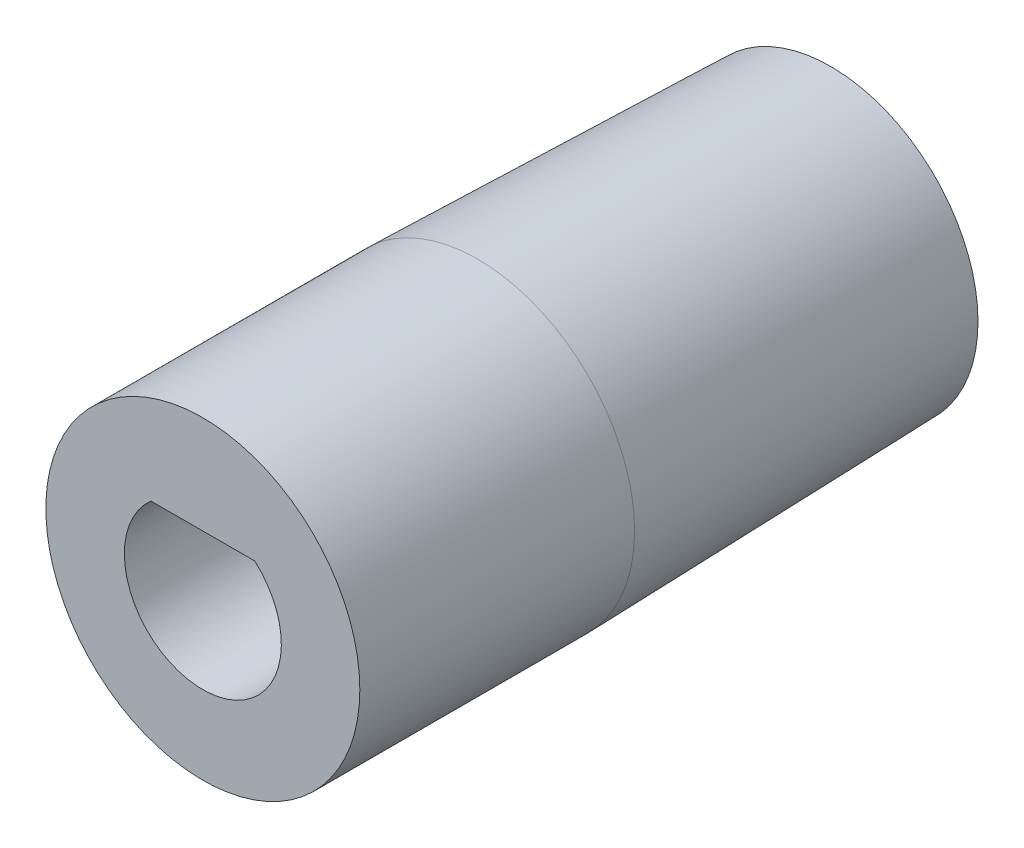
ISO-10303-21;
HEADER;
FILE_DESCRIPTION(('STEP AP214'),'2;1');
FILE_NAME('part.step','',(''),(''),'','','');
FILE_SCHEMA(('AUTOMOTIVE_DESIGN { 1 0 10303 214 1 1 1 1 }'));
ENDSEC;
DATA;
#1=APPLICATION_CONTEXT('core data for automotive mechanical design processes');
#2=APPLICATION_PROTOCOL_DEFINITION('international standard','automotive_design',2000,#1);
#3=PRODUCT_CONTEXT('',#1,'mechanical');
#4=PRODUCT('Part','Part','',(#3));
#5=PRODUCT_RELATED_PRODUCT_CATEGORY('part','',(#4));
#6=PRODUCT_DEFINITION_FORMATION('','',#4);
#7=PRODUCT_DEFINITION_CONTEXT('part definition',#1,'design');
#8=PRODUCT_DEFINITION('design','',#6,#7);
#9=PRODUCT_DEFINITION_SHAPE('','',#8);
#10=(LENGTH_UNIT() NAMED_UNIT(*) SI_UNIT(.MILLI.,.METRE.));
#11=(NAMED_UNIT(*) PLANE_ANGLE_UNIT() SI_UNIT($,.RADIAN.));
#12=(NAMED_UNIT(*) SI_UNIT($,.STERADIAN.) SOLID_ANGLE_UNIT());
#13=UNCERTAINTY_MEASURE_WITH_UNIT(LENGTH_MEASURE(1.E-05),#10,'distance_accuracy_value','');
#14=(GEOMETRIC_REPRESENTATION_CONTEXT(3) GLOBAL_UNCERTAINTY_ASSIGNED_CONTEXT((#13)) GLOBAL_UNIT_ASSIGNED_CONTEXT((#10,
#11,#12)) REPRESENTATION_CONTEXT('',''));
#15=CARTESIAN_POINT('',(0.,0.,0.));
#16=DIRECTION('',(0.,0.,1.));
#17=DIRECTION('',(1.,0.,0.));
#18=AXIS2_PLACEMENT_3D('',#15,#16,#17);
#19=CARTESIAN_POINT('',(0.,0.,-9.));
#20=DIRECTION('',(0.,0.,-1.));
#21=DIRECTION('',(-1.,0.,0.));
#22=AXIS2_PLACEMENT_3D('',#19,#20,#21);
#23=PLANE('',#22);
#24=CARTESIAN_POINT('',(0.,0.,-9.00000000000001));
#25=DIRECTION('',(0.,0.,-1.));
#26=DIRECTION('',(-1.,0.,0.));
#27=AXIS2_PLACEMENT_3D('',#24,#25,#26);
#28=CIRCLE('',#27,1.64999999999999);
#29=CARTESIAN_POINT('',(-1.64999999999999,0.,-9.00000000000001));
#30=VERTEX_POINT('',#29);
#31=EDGE_CURVE('E97',#30,#30,#28,.T.);
#32=ORIENTED_EDGE('',*,*,#31,.F.);
#33=EDGE_LOOP('',(#32));
#34=FACE_BOUND('',#33,.T.);
#35=CARTESIAN_POINT('',(0.,0.,-9.));
#36=DIRECTION('',(0.,0.,1.));
#37=DIRECTION('',(1.,0.,0.));
#38=AXIS2_PLACEMENT_3D('',#35,#36,#37);
#39=CIRCLE('',#38,3.75);
#40=CARTESIAN_POINT('',(3.75,0.,-9.));
#41=VERTEX_POINT('',#40);
#42=EDGE_CURVE('E51',#41,#41,#39,.T.);
#43=ORIENTED_EDGE('',*,*,#42,.F.);
#44=EDGE_LOOP('',(#43));
#45=FACE_BOUND('',#44,.T.);
#46=ADVANCED_FACE('F39',(#34,#45),#23,.T.);
#47=CARTESIAN_POINT('',(0.,0.,0.));
#48=DIRECTION('',(0.,0.,1.));
#49=DIRECTION('',(1.,0.,0.));
#50=AXIS2_PLACEMENT_3D('',#47,#48,#49);
#51=CONICAL_SURFACE('',#50,4.,0.0277706365934211);
#52=ORIENTED_EDGE('',*,*,#42,.T.);
#53=EDGE_LOOP('',(#52));
#54=FACE_BOUND('',#53,.T.);
#55=CARTESIAN_POINT('',(0.,0.,0.));
#56=DIRECTION('',(0.,0.,1.));
#57=DIRECTION('',(1.,0.,0.));
#58=AXIS2_PLACEMENT_3D('',#55,#56,#57);
#59=CIRCLE('',#58,4.);
#60=CARTESIAN_POINT('',(4.,0.,0.));
#61=VERTEX_POINT('',#60);
#62=EDGE_CURVE('E108',#61,#61,#59,.T.);
#63=ORIENTED_EDGE('',*,*,#62,.F.);
#64=EDGE_LOOP('',(#63));
#65=FACE_BOUND('',#64,.T.);
#66=ADVANCED_FACE('F113',(#54,#65),#51,.T.);
#67=CARTESIAN_POINT('',(0.,0.,7.));
#68=DIRECTION('',(0.,0.,-1.));
#69=DIRECTION('',(-1.,0.,0.));
#70=AXIS2_PLACEMENT_3D('',#67,#68,#69);
#71=CYLINDRICAL_SURFACE('',#70,4.);
#72=CARTESIAN_POINT('',(0.,0.,7.));
#73=DIRECTION('',(0.,0.,1.));
#74=DIRECTION('',(1.,0.,0.));
#75=AXIS2_PLACEMENT_3D('',#72,#73,#74);
#76=CIRCLE('',#75,4.);
#77=CARTESIAN_POINT('',(4.,0.,7.));
#78=VERTEX_POINT('',#77);
#79=EDGE_CURVE('E105',#78,#78,#76,.T.);
#80=ORIENTED_EDGE('',*,*,#79,.F.);
#81=EDGE_LOOP('',(#80));
#82=FACE_BOUND('',#81,.T.);
#83=ORIENTED_EDGE('',*,*,#62,.T.);
#84=EDGE_LOOP('',(#83));
#85=FACE_BOUND('',#84,.T.);
#86=ADVANCED_FACE('F121',(#82,#85),#71,.T.);
#87=CARTESIAN_POINT('',(0.,0.,7.));
#88=DIRECTION('',(0.,0.,1.));
#89=DIRECTION('',(1.,0.,0.));
#90=AXIS2_PLACEMENT_3D('',#87,#88,#89);
#91=PLANE('',#90);
#92=CARTESIAN_POINT('',(0.,0.,7.));
#93=DIRECTION('',(0.,0.,1.));
#94=DIRECTION('',(1.,0.,0.));
#95=AXIS2_PLACEMENT_3D('',#92,#93,#94);
#96=CIRCLE('',#95,2.);
#97=CARTESIAN_POINT('',(-1.3228756555323,1.5,7.));
#98=VERTEX_POINT('',#97);
#99=CARTESIAN_POINT('',(1.3228756555323,1.5,7.));
#100=VERTEX_POINT('',#99);
#101=EDGE_CURVE('E58',#98,#100,#96,.T.);
#102=ORIENTED_EDGE('',*,*,#101,.F.);
#103=DIRECTION('',(-1.,0.,0.));
#104=VECTOR('',#103,1.);
#105=CARTESIAN_POINT('',(-1.3228756555323,1.5,7.));
#106=LINE('',#105,#104);
#107=EDGE_CURVE('E89',#100,#98,#106,.T.);
#108=ORIENTED_EDGE('',*,*,#107,.F.);
#109=EDGE_LOOP('',(#102,#108));
#110=FACE_BOUND('',#109,.T.);
#111=ORIENTED_EDGE('',*,*,#79,.T.);
#112=EDGE_LOOP('',(#111));
#113=FACE_BOUND('',#112,.T.);
#114=ADVANCED_FACE('F133',(#110,#113),#91,.T.);
#115=CARTESIAN_POINT('',(0.,0.,0.));
#116=DIRECTION('',(0.,0.,-1.));
#117=DIRECTION('',(-1.,0.,0.));
#118=AXIS2_PLACEMENT_3D('',#115,#116,#117);
#119=CONICAL_SURFACE('',#118,1.65,1.02974425867665);
#120=CARTESIAN_POINT('',(0.,0.,0.));
#121=DIRECTION('',(0.,0.,-1.));
#122=DIRECTION('',(-1.,0.,0.));
#123=AXIS2_PLACEMENT_3D('',#120,#121,#122);
#124=CIRCLE('',#123,1.65);
#125=CARTESIAN_POINT('',(-0.687386354243362,1.5,0.));
#126=VERTEX_POINT('',#125);
#127=CARTESIAN_POINT('',(0.687386354243364,1.5,0.));
#128=VERTEX_POINT('',#127);
#129=EDGE_CURVE('E102',#126,#128,#124,.T.);
#130=ORIENTED_EDGE('',*,*,#129,.T.);
#131=CARTESIAN_POINT('',(-2.62129211735031,1.5,-0.823255881441348));
#132=CARTESIAN_POINT('',(-2.55317690766389,1.5,-0.787740354690675));
#133=CARTESIAN_POINT('',(-2.48492608561878,1.5,-0.752481562879488));
#134=CARTESIAN_POINT('',(-2.34808190716429,1.5,-0.682617726056574));
#135=CARTESIAN_POINT('',(-2.27948851554243,1.5,-0.648012750074673));
#136=CARTESIAN_POINT('',(-2.1416392878337,1.5,-0.579473636839051));
#137=CARTESIAN_POINT('',(-2.07238192197568,1.5,-0.545542568345838));
#138=CARTESIAN_POINT('',(-1.93338250244624,1.5,-0.478692094604656));
#139=CARTESIAN_POINT('',(-1.86364046612533,1.5,-0.445772653368298));
#140=CARTESIAN_POINT('',(-1.72005376408922,1.5,-0.379590197673312));
#141=CARTESIAN_POINT('',(-1.64617875128944,1.5,-0.34639274307351));
#142=CARTESIAN_POINT('',(-1.4976371162768,1.5,-0.281821411530715));
#143=CARTESIAN_POINT('',(-1.42297054430348,1.5,-0.250447419663843));
#144=CARTESIAN_POINT('',(-1.27277026603238,1.5,-0.190127145231652));
#145=CARTESIAN_POINT('',(-1.19723783765751,1.5,-0.16117770569278));
#146=CARTESIAN_POINT('',(-1.04504748106455,1.5,-0.106431359305615));
#147=CARTESIAN_POINT('',(-0.968389841149469,1.5,-0.0806336601798966));
#148=CARTESIAN_POINT('',(-0.814488504473511,1.5,-0.033405443889945));
#149=CARTESIAN_POINT('',(-0.737256595072884,1.5,-0.0119371132089255));
#150=CARTESIAN_POINT('',(-0.581498509733473,1.5,0.025721517827805));
#151=CARTESIAN_POINT('',(-0.502972505290599,1.5,0.0419125117302781));
#152=CARTESIAN_POINT('',(-0.346185480603574,1.5,0.0675266889656693));
#153=CARTESIAN_POINT('',(-0.267943255123432,1.5,0.0770617975399857));
#154=CARTESIAN_POINT('',(-0.110905129003077,1.5,0.0888800428854984));
#155=CARTESIAN_POINT('',(-0.0321092985171722,1.5,0.0911640824929375));
#156=CARTESIAN_POINT('',(0.130540516029872,1.5,0.0881267555985288));
#157=CARTESIAN_POINT('',(0.214384848657547,1.5,0.0822931060057361));
#158=CARTESIAN_POINT('',(0.381173174249932,1.5,0.0627884985427491));
#159=CARTESIAN_POINT('',(0.464116682330804,1.5,0.0491135141714224));
#160=CARTESIAN_POINT('',(0.588446236664529,1.5,0.0235495066837341));
#161=CARTESIAN_POINT('',(0.630347710719991,1.5,0.0140491041029444));
#162=CARTESIAN_POINT('',(0.713767510774454,1.5,-0.00644599690610521));
#163=CARTESIAN_POINT('',(0.755285982746923,1.5,-0.0174400985934751));
#164=CARTESIAN_POINT('',(0.837957708149005,1.5,-0.0407387064564897));
#165=CARTESIAN_POINT('',(0.879110903891714,1.5,-0.0530434157591338));
#166=CARTESIAN_POINT('',(0.961060657690073,1.5,-0.0787901004090543));
#167=CARTESIAN_POINT('',(1.00185719606835,1.5,-0.0922321380731491));
#168=CARTESIAN_POINT('',(1.13452668990583,1.5,-0.137721680655204));
#169=CARTESIAN_POINT('',(1.22570817266657,1.5,-0.171789056125083));
#170=CARTESIAN_POINT('',(1.40666138805668,1.5,-0.243502624632599));
#171=CARTESIAN_POINT('',(1.49643263391104,1.5,-0.281150023086333));
#172=CARTESIAN_POINT('',(1.67492960347844,1.5,-0.359063400820723));
#173=CARTESIAN_POINT('',(1.76365422037564,1.5,-0.399331901792738));
#174=CARTESIAN_POINT('',(1.94021602967351,1.5,-0.481775522489419));
#175=CARTESIAN_POINT('',(2.02805315097338,1.5,-0.523950793514262));
#176=CARTESIAN_POINT('',(2.29124753836351,1.5,-0.652939388361775));
#177=CARTESIAN_POINT('',(2.46555645830153,1.5,-0.74188584322303));
#178=CARTESIAN_POINT('',(2.81231501071639,1.5,-0.923043809795107));
#179=CARTESIAN_POINT('',(2.98476569320149,1.5,-1.01525333619778));
#180=CARTESIAN_POINT('',(3.30539404510052,1.5,-1.18926307836128));
#181=CARTESIAN_POINT('',(3.45371728073092,1.5,-1.27079559273617));
#182=CARTESIAN_POINT('',(3.74976077908469,1.5,-1.43500633494317));
#183=CARTESIAN_POINT('',(3.89748093139098,1.5,-1.5176847613827));
#184=CARTESIAN_POINT('',(4.19127279824297,1.5,-1.68319753786779));
#185=CARTESIAN_POINT('',(4.33734822561076,1.5,-1.76602530670761));
#186=CARTESIAN_POINT('',(4.62911552225837,1.5,-1.93228601032601));
#187=CARTESIAN_POINT('',(4.77480746279413,1.5,-2.01571881999732));
#188=CARTESIAN_POINT('',(4.92037368225185,1.5,-2.09936852449339));
#189=B_SPLINE_CURVE_WITH_KNOTS('',3,(#131,#132,#133,#134,#135,#136,#137,#138,#139,#140,#141,
#142,#143,#144,#145,#146,#147,#148,#149,#150,#151,#152,#153,#154,#155,#156,#157,#158,#159,#160,
#161,#162,#163,#164,#165,#166,#167,#168,#169,#170,#171,#172,#173,#174,#175,#176,#177,#178,#179,
#180,#181,#182,#183,#184,#185,#186,#187,#188),.UNSPECIFIED.,.F.,.F.,(4,2,2,2,2,2,2,2,2,2,2,2,2,
2,2,2,2,2,2,2,2,2,2,2,2,2,2,2,4),(0.,0.230456339072595,0.460936875253175,0.692298139577544,
0.923651163731758,1.16660630121073,1.40954610978156,1.65216450598547,1.89472178728128,
2.13505881943003,2.37536425377713,2.61152448356033,2.84765530769597,3.09938202509304,
3.35123811928383,3.48011103939828,3.60893262465059,3.73777420469226,3.86662284883569,
4.15851320252411,4.45050218787824,4.7427763631115,5.03507377083347,5.62207390671723,
6.20872284301244,6.71648134416096,7.22432897781057,7.72809929331227,8.23176825425522),.UNSPECIFIED.);
#190=EDGE_CURVE('E11',#128,#126,#189,.F.);
#191=ORIENTED_EDGE('',*,*,#190,.T.);
#192=EDGE_LOOP('',(#130,#191));
#193=FACE_BOUND('',#192,.T.);
#194=ADVANCED_FACE('F126',(#193),#119,.F.);
#195=CARTESIAN_POINT('',(0.,0.,-9.));
#196=DIRECTION('',(0.,0.,-1.));
#197=DIRECTION('',(-1.,0.,0.));
#198=AXIS2_PLACEMENT_3D('',#195,#196,#197);
#199=CYLINDRICAL_SURFACE('',#198,1.64999999999999);
#200=ORIENTED_EDGE('',*,*,#129,.F.);
#201=EDGE_CURVE('E101',#128,#126,#124,.T.);
#202=ORIENTED_EDGE('',*,*,#201,.F.);
#203=EDGE_LOOP('',(#200,#202));
#204=FACE_BOUND('',#203,.T.);
#205=ORIENTED_EDGE('',*,*,#31,.T.);
#206=EDGE_LOOP('',(#205));
#207=FACE_BOUND('',#206,.T.);
#208=ADVANCED_FACE('F124',(#204,#207),#199,.F.);
#209=CARTESIAN_POINT('',(-1.3228756555323,1.5,0.));
#210=DIRECTION('',(0.,1.,0.));
#211=DIRECTION('',(0.,0.,1.));
#212=AXIS2_PLACEMENT_3D('',#209,#210,#211);
#213=PLANE('',#212);
#214=DIRECTION('',(-1.,0.,0.));
#215=VECTOR('',#214,1.);
#216=CARTESIAN_POINT('',(-1.3228756555323,1.5,0.));
#217=LINE('',#216,#215);
#218=CARTESIAN_POINT('',(1.3228756555323,1.5,0.));
#219=VERTEX_POINT('',#218);
#220=EDGE_CURVE('E66',#219,#128,#217,.T.);
#221=ORIENTED_EDGE('',*,*,#220,.F.);
#222=DIRECTION('',(0.,0.,1.));
#223=VECTOR('',#222,1.);
#224=CARTESIAN_POINT('',(1.3228756555323,1.5,0.));
#225=LINE('',#224,#223);
#226=EDGE_CURVE('E77',#219,#100,#225,.T.);
#227=ORIENTED_EDGE('',*,*,#226,.T.);
#228=ORIENTED_EDGE('',*,*,#107,.T.);
#229=DIRECTION('',(0.,0.,1.));
#230=VECTOR('',#229,1.);
#231=CARTESIAN_POINT('',(-1.3228756555323,1.5,0.));
#232=LINE('',#231,#230);
#233=CARTESIAN_POINT('',(-1.3228756555323,1.5,0.));
#234=VERTEX_POINT('',#233);
#235=EDGE_CURVE('E83',#234,#98,#232,.T.);
#236=ORIENTED_EDGE('',*,*,#235,.F.);
#237=EDGE_CURVE('E87',#126,#234,#217,.T.);
#238=ORIENTED_EDGE('',*,*,#237,.F.);
#239=ORIENTED_EDGE('',*,*,#190,.F.);
#240=EDGE_LOOP('',(#221,#227,#228,#236,#238,#239));
#241=FACE_BOUND('',#240,.T.);
#242=ADVANCED_FACE('F91',(#241),#213,.F.);
#243=CARTESIAN_POINT('',(0.,0.,0.));
#244=DIRECTION('',(0.,0.,1.));
#245=DIRECTION('',(1.,0.,0.));
#246=AXIS2_PLACEMENT_3D('',#243,#244,#245);
#247=PLANE('',#246);
#248=ORIENTED_EDGE('',*,*,#201,.T.);
#249=ORIENTED_EDGE('',*,*,#237,.T.);
#250=CARTESIAN_POINT('',(0.,0.,0.));
#251=DIRECTION('',(0.,0.,1.));
#252=DIRECTION('',(1.,0.,0.));
#253=AXIS2_PLACEMENT_3D('',#250,#251,#252);
#254=CIRCLE('',#253,2.);
#255=EDGE_CURVE('E79',#234,#219,#254,.T.);
#256=ORIENTED_EDGE('',*,*,#255,.T.);
#257=ORIENTED_EDGE('',*,*,#220,.T.);
#258=EDGE_LOOP('',(#248,#249,#256,#257));
#259=FACE_BOUND('',#258,.T.);
#260=ADVANCED_FACE('F85',(#259),#247,.T.);
#261=CARTESIAN_POINT('',(0.,0.,0.));
#262=DIRECTION('',(0.,0.,1.));
#263=DIRECTION('',(1.,0.,0.));
#264=AXIS2_PLACEMENT_3D('',#261,#262,#263);
#265=CYLINDRICAL_SURFACE('',#264,2.);
#266=ORIENTED_EDGE('',*,*,#101,.T.);
#267=ORIENTED_EDGE('',*,*,#226,.F.);
#268=ORIENTED_EDGE('',*,*,#255,.F.);
#269=ORIENTED_EDGE('',*,*,#235,.T.);
#270=EDGE_LOOP('',(#266,#267,#268,#269));
#271=FACE_BOUND('',#270,.T.);
#272=ADVANCED_FACE('F78',(#271),#265,.F.);
#273=CLOSED_SHELL('',(#46,#66,#86,#114,#194,#208,#242,#260,#272));
#274=MANIFOLD_SOLID_BREP('B2',#273);
#275=ADVANCED_BREP_SHAPE_REPRESENTATION('',(#18,#274),#14);
#276=SHAPE_DEFINITION_REPRESENTATION(#9,#275);
ENDSEC;
END-ISO-10303-21;
